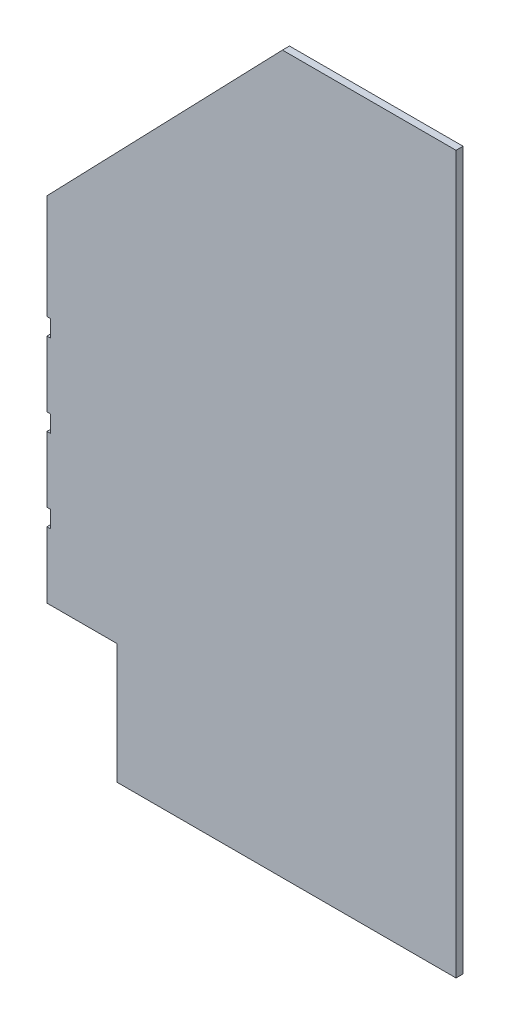
ISO-10303-21;
HEADER;
FILE_DESCRIPTION(('STEP AP214'),'2;1');
FILE_NAME('part.step','',(''),(''),'','','');
FILE_SCHEMA(('AUTOMOTIVE_DESIGN { 1 0 10303 214 1 1 1 1 }'));
ENDSEC;
DATA;
#1=APPLICATION_CONTEXT('core data for automotive mechanical design processes');
#2=APPLICATION_PROTOCOL_DEFINITION('international standard','automotive_design',2000,#1);
#3=PRODUCT_CONTEXT('',#1,'mechanical');
#4=PRODUCT('Part','Part','',(#3));
#5=PRODUCT_RELATED_PRODUCT_CATEGORY('part','',(#4));
#6=PRODUCT_DEFINITION_FORMATION('','',#4);
#7=PRODUCT_DEFINITION_CONTEXT('part definition',#1,'design');
#8=PRODUCT_DEFINITION('design','',#6,#7);
#9=PRODUCT_DEFINITION_SHAPE('','',#8);
#10=(LENGTH_UNIT() NAMED_UNIT(*) SI_UNIT(.MILLI.,.METRE.));
#11=(NAMED_UNIT(*) PLANE_ANGLE_UNIT() SI_UNIT($,.RADIAN.));
#12=(NAMED_UNIT(*) SI_UNIT($,.STERADIAN.) SOLID_ANGLE_UNIT());
#13=UNCERTAINTY_MEASURE_WITH_UNIT(LENGTH_MEASURE(1.E-05),#10,'distance_accuracy_value','');
#14=(GEOMETRIC_REPRESENTATION_CONTEXT(3) GLOBAL_UNCERTAINTY_ASSIGNED_CONTEXT((#13)) GLOBAL_UNIT_ASSIGNED_CONTEXT((#10,
#11,#12)) REPRESENTATION_CONTEXT('',''));
#15=CARTESIAN_POINT('',(0.,0.,0.));
#16=DIRECTION('',(0.,0.,1.));
#17=DIRECTION('',(1.,0.,0.));
#18=AXIS2_PLACEMENT_3D('',#15,#16,#17);
#19=CARTESIAN_POINT('',(-284.234659090909,-116.031818181818,11.90625));
#20=DIRECTION('',(1.,0.,0.));
#21=DIRECTION('',(0.,0.,-1.));
#22=AXIS2_PLACEMENT_3D('',#19,#20,#21);
#23=PLANE('',#22);
#24=DIRECTION('',(0.,-1.,0.));
#25=VECTOR('',#24,1.);
#26=CARTESIAN_POINT('',(-284.234659090909,-116.031818181818,0.));
#27=LINE('',#26,#25);
#28=CARTESIAN_POINT('',(-284.234659090909,-461.281318181818,0.));
#29=VERTEX_POINT('',#28);
#30=CARTESIAN_POINT('',(-284.234659090909,-572.406318181818,0.));
#31=VERTEX_POINT('',#30);
#32=EDGE_CURVE('E186',#29,#31,#27,.T.);
#33=ORIENTED_EDGE('',*,*,#32,.T.);
#34=DIRECTION('',(0.,0.,1.));
#35=VECTOR('',#34,1.);
#36=CARTESIAN_POINT('',(-284.234659090909,-572.406318181818,0.));
#37=LINE('',#36,#35);
#38=CARTESIAN_POINT('',(-284.234659090909,-572.406318181818,11.90625));
#39=VERTEX_POINT('',#38);
#40=EDGE_CURVE('E193',#31,#39,#37,.T.);
#41=ORIENTED_EDGE('',*,*,#40,.T.);
#42=DIRECTION('',(0.,-1.,0.));
#43=VECTOR('',#42,1.);
#44=CARTESIAN_POINT('',(-284.234659090909,-116.031818181818,11.90625));
#45=LINE('',#44,#43);
#46=CARTESIAN_POINT('',(-284.234659090909,-461.281318181818,11.90625));
#47=VERTEX_POINT('',#46);
#48=EDGE_CURVE('E309',#47,#39,#45,.T.);
#49=ORIENTED_EDGE('',*,*,#48,.F.);
#50=DIRECTION('',(0.,0.,1.));
#51=VECTOR('',#50,1.);
#52=CARTESIAN_POINT('',(-284.234659090909,-461.281318181818,0.));
#53=LINE('',#52,#51);
#54=EDGE_CURVE('E218',#29,#47,#53,.T.);
#55=ORIENTED_EDGE('',*,*,#54,.F.);
#56=EDGE_LOOP('',(#33,#41,#49,#55));
#57=FACE_BOUND('',#56,.T.);
#58=ADVANCED_FACE('F32',(#57),#23,.F.);
#59=CARTESIAN_POINT('',(-284.234659090909,-321.581318181818,0.));
#60=VERTEX_POINT('',#59);
#61=CARTESIAN_POINT('',(-284.234659090909,-432.706318181818,0.));
#62=VERTEX_POINT('',#61);
#63=EDGE_CURVE('E191',#60,#62,#27,.T.);
#64=ORIENTED_EDGE('',*,*,#63,.T.);
#65=DIRECTION('',(0.,0.,1.));
#66=VECTOR('',#65,1.);
#67=CARTESIAN_POINT('',(-284.234659090909,-432.706318181818,0.));
#68=LINE('',#67,#66);
#69=CARTESIAN_POINT('',(-284.234659090909,-432.706318181818,11.90625));
#70=VERTEX_POINT('',#69);
#71=EDGE_CURVE('E207',#62,#70,#68,.T.);
#72=ORIENTED_EDGE('',*,*,#71,.T.);
#73=CARTESIAN_POINT('',(-284.234659090909,-321.581318181818,11.90625));
#74=VERTEX_POINT('',#73);
#75=EDGE_CURVE('E268',#74,#70,#45,.T.);
#76=ORIENTED_EDGE('',*,*,#75,.F.);
#77=DIRECTION('',(0.,0.,1.));
#78=VECTOR('',#77,1.);
#79=CARTESIAN_POINT('',(-284.234659090909,-321.581318181818,0.));
#80=LINE('',#79,#78);
#81=EDGE_CURVE('E209',#60,#74,#80,.T.);
#82=ORIENTED_EDGE('',*,*,#81,.F.);
#83=EDGE_LOOP('',(#64,#72,#76,#82));
#84=FACE_BOUND('',#83,.T.);
#85=ADVANCED_FACE('F205',(#84),#23,.F.);
#86=CARTESIAN_POINT('',(-284.234659090909,-116.031818181818,0.));
#87=VERTEX_POINT('',#86);
#88=CARTESIAN_POINT('',(-284.234659090909,-293.006318181818,0.));
#89=VERTEX_POINT('',#88);
#90=EDGE_CURVE('E189',#87,#89,#27,.T.);
#91=ORIENTED_EDGE('',*,*,#90,.T.);
#92=DIRECTION('',(0.,0.,1.));
#93=VECTOR('',#92,1.);
#94=CARTESIAN_POINT('',(-284.234659090909,-293.006318181818,0.));
#95=LINE('',#94,#93);
#96=CARTESIAN_POINT('',(-284.234659090909,-293.006318181818,11.90625));
#97=VERTEX_POINT('',#96);
#98=EDGE_CURVE('E230',#89,#97,#95,.T.);
#99=ORIENTED_EDGE('',*,*,#98,.T.);
#100=CARTESIAN_POINT('',(-284.234659090909,-116.031818181818,11.90625));
#101=VERTEX_POINT('',#100);
#102=EDGE_CURVE('E264',#101,#97,#45,.T.);
#103=ORIENTED_EDGE('',*,*,#102,.F.);
#104=DIRECTION('',(0.,0.,-1.));
#105=VECTOR('',#104,1.);
#106=CARTESIAN_POINT('',(-284.234659090909,-116.031818181818,11.90625));
#107=LINE('',#106,#105);
#108=EDGE_CURVE('E11',#101,#87,#107,.T.);
#109=ORIENTED_EDGE('',*,*,#108,.T.);
#110=EDGE_LOOP('',(#91,#99,#103,#109));
#111=FACE_BOUND('',#110,.T.);
#112=ADVANCED_FACE('F326',(#111),#23,.F.);
#113=CARTESIAN_POINT('',(114.22784090909,296.718181818182,11.90625));
#114=DIRECTION('',(0.719449138392046,-0.694545129755398,0.));
#115=DIRECTION('',(0.694545129755398,0.719449138392046,0.));
#116=AXIS2_PLACEMENT_3D('',#113,#114,#115);
#117=PLANE('',#116);
#118=DIRECTION('',(-0.694545129755398,-0.719449138392046,0.));
#119=VECTOR('',#118,1.);
#120=CARTESIAN_POINT('',(114.22784090909,296.718181818182,0.));
#121=LINE('',#120,#119);
#122=CARTESIAN_POINT('',(114.22784090909,296.718181818182,0.));
#123=VERTEX_POINT('',#122);
#124=EDGE_CURVE('E187',#123,#87,#121,.T.);
#125=ORIENTED_EDGE('',*,*,#124,.T.);
#126=ORIENTED_EDGE('',*,*,#108,.F.);
#127=DIRECTION('',(-0.694545129755398,-0.719449138392046,0.));
#128=VECTOR('',#127,1.);
#129=CARTESIAN_POINT('',(114.22784090909,296.718181818182,11.90625));
#130=LINE('',#129,#128);
#131=CARTESIAN_POINT('',(114.22784090909,296.718181818182,11.90625));
#132=VERTEX_POINT('',#131);
#133=EDGE_CURVE('E260',#132,#101,#130,.T.);
#134=ORIENTED_EDGE('',*,*,#133,.F.);
#135=DIRECTION('',(0.,0.,-1.));
#136=VECTOR('',#135,1.);
#137=CARTESIAN_POINT('',(114.22784090909,296.718181818182,11.90625));
#138=LINE('',#137,#136);
#139=EDGE_CURVE('E277',#132,#123,#138,.T.);
#140=ORIENTED_EDGE('',*,*,#139,.T.);
#141=EDGE_LOOP('',(#125,#126,#134,#140));
#142=FACE_BOUND('',#141,.T.);
#143=ADVANCED_FACE('F34',(#142),#117,.F.);
#144=CARTESIAN_POINT('',(-284.234659090909,-600.981318181818,11.90625));
#145=VERTEX_POINT('',#144);
#146=CARTESIAN_POINT('',(-284.234659090909,-712.931818181818,11.90625));
#147=VERTEX_POINT('',#146);
#148=EDGE_CURVE('E179',#145,#147,#45,.T.);
#149=ORIENTED_EDGE('',*,*,#148,.F.);
#150=DIRECTION('',(0.,0.,1.));
#151=VECTOR('',#150,1.);
#152=CARTESIAN_POINT('',(-284.234659090909,-600.981318181818,0.));
#153=LINE('',#152,#151);
#154=CARTESIAN_POINT('',(-284.234659090909,-600.981318181818,0.));
#155=VERTEX_POINT('',#154);
#156=EDGE_CURVE('E166',#155,#145,#153,.T.);
#157=ORIENTED_EDGE('',*,*,#156,.F.);
#158=CARTESIAN_POINT('',(-284.234659090909,-712.931818181818,0.));
#159=VERTEX_POINT('',#158);
#160=EDGE_CURVE('E177',#155,#159,#27,.T.);
#161=ORIENTED_EDGE('',*,*,#160,.T.);
#162=DIRECTION('',(0.,0.,-1.));
#163=VECTOR('',#162,1.);
#164=CARTESIAN_POINT('',(-284.234659090909,-712.931818181818,11.90625));
#165=LINE('',#164,#163);
#166=EDGE_CURVE('E40',#147,#159,#165,.T.);
#167=ORIENTED_EDGE('',*,*,#166,.F.);
#168=EDGE_LOOP('',(#149,#157,#161,#167));
#169=FACE_BOUND('',#168,.T.);
#170=ADVANCED_FACE('F175',(#169),#23,.F.);
#171=CARTESIAN_POINT('',(-284.234659090909,-712.931818181818,11.90625));
#172=DIRECTION('',(0.,1.,0.));
#173=DIRECTION('',(0.,0.,1.));
#174=AXIS2_PLACEMENT_3D('',#171,#172,#173);
#175=PLANE('',#174);
#176=DIRECTION('',(1.,0.,0.));
#177=VECTOR('',#176,1.);
#178=CARTESIAN_POINT('',(-284.234659090909,-712.931818181818,0.));
#179=LINE('',#178,#177);
#180=CARTESIAN_POINT('',(-165.965909090909,-712.931818181818,0.));
#181=VERTEX_POINT('',#180);
#182=EDGE_CURVE('E185',#159,#181,#179,.T.);
#183=ORIENTED_EDGE('',*,*,#182,.T.);
#184=DIRECTION('',(0.,0.,-1.));
#185=VECTOR('',#184,1.);
#186=CARTESIAN_POINT('',(-165.965909090909,-712.931818181818,11.90625));
#187=LINE('',#186,#185);
#188=CARTESIAN_POINT('',(-165.965909090909,-712.931818181818,11.90625));
#189=VERTEX_POINT('',#188);
#190=EDGE_CURVE('E298',#189,#181,#187,.T.);
#191=ORIENTED_EDGE('',*,*,#190,.F.);
#192=DIRECTION('',(1.,0.,0.));
#193=VECTOR('',#192,1.);
#194=CARTESIAN_POINT('',(-284.234659090909,-712.931818181818,11.90625));
#195=LINE('',#194,#193);
#196=EDGE_CURVE('E267',#147,#189,#195,.T.);
#197=ORIENTED_EDGE('',*,*,#196,.F.);
#198=ORIENTED_EDGE('',*,*,#166,.T.);
#199=EDGE_LOOP('',(#183,#191,#197,#198));
#200=FACE_BOUND('',#199,.T.);
#201=ADVANCED_FACE('F302',(#200),#175,.F.);
#202=CARTESIAN_POINT('',(-165.965909090909,-916.131818181818,11.90625));
#203=DIRECTION('',(1.,0.,0.));
#204=DIRECTION('',(0.,0.,-1.));
#205=AXIS2_PLACEMENT_3D('',#202,#203,#204);
#206=PLANE('',#205);
#207=DIRECTION('',(0.,-1.,0.));
#208=VECTOR('',#207,1.);
#209=CARTESIAN_POINT('',(-165.965909090909,-916.131818181818,0.));
#210=LINE('',#209,#208);
#211=CARTESIAN_POINT('',(-165.965909090909,-916.131818181818,0.));
#212=VERTEX_POINT('',#211);
#213=EDGE_CURVE('E199',#181,#212,#210,.T.);
#214=ORIENTED_EDGE('',*,*,#213,.T.);
#215=DIRECTION('',(0.,0.,-1.));
#216=VECTOR('',#215,1.);
#217=CARTESIAN_POINT('',(-165.965909090909,-916.131818181818,11.90625));
#218=LINE('',#217,#216);
#219=CARTESIAN_POINT('',(-165.965909090909,-916.131818181818,11.90625));
#220=VERTEX_POINT('',#219);
#221=EDGE_CURVE('E295',#220,#212,#218,.T.);
#222=ORIENTED_EDGE('',*,*,#221,.F.);
#223=DIRECTION('',(0.,-1.,0.));
#224=VECTOR('',#223,1.);
#225=CARTESIAN_POINT('',(-165.965909090909,-916.131818181818,11.90625));
#226=LINE('',#225,#224);
#227=EDGE_CURVE('E270',#189,#220,#226,.T.);
#228=ORIENTED_EDGE('',*,*,#227,.F.);
#229=ORIENTED_EDGE('',*,*,#190,.T.);
#230=EDGE_LOOP('',(#214,#222,#228,#229));
#231=FACE_BOUND('',#230,.T.);
#232=ADVANCED_FACE('F339',(#231),#206,.F.);
#233=CARTESIAN_POINT('',(-165.965909090909,-916.131818181818,11.90625));
#234=DIRECTION('',(0.,1.,0.));
#235=DIRECTION('',(0.,0.,1.));
#236=AXIS2_PLACEMENT_3D('',#233,#234,#235);
#237=PLANE('',#236);
#238=DIRECTION('',(1.,0.,0.));
#239=VECTOR('',#238,1.);
#240=CARTESIAN_POINT('',(-165.965909090909,-916.131818181818,0.));
#241=LINE('',#240,#239);
#242=CARTESIAN_POINT('',(407.91534090909,-916.131818181818,0.));
#243=VERTEX_POINT('',#242);
#244=EDGE_CURVE('E333',#212,#243,#241,.T.);
#245=ORIENTED_EDGE('',*,*,#244,.T.);
#246=DIRECTION('',(0.,0.,-1.));
#247=VECTOR('',#246,1.);
#248=CARTESIAN_POINT('',(407.91534090909,-916.131818181818,11.90625));
#249=LINE('',#248,#247);
#250=CARTESIAN_POINT('',(407.91534090909,-916.131818181818,11.90625));
#251=VERTEX_POINT('',#250);
#252=EDGE_CURVE('E288',#251,#243,#249,.T.);
#253=ORIENTED_EDGE('',*,*,#252,.F.);
#254=DIRECTION('',(1.,0.,0.));
#255=VECTOR('',#254,1.);
#256=CARTESIAN_POINT('',(-165.965909090909,-916.131818181818,11.90625));
#257=LINE('',#256,#255);
#258=EDGE_CURVE('E272',#220,#251,#257,.T.);
#259=ORIENTED_EDGE('',*,*,#258,.F.);
#260=ORIENTED_EDGE('',*,*,#221,.T.);
#261=EDGE_LOOP('',(#245,#253,#259,#260));
#262=FACE_BOUND('',#261,.T.);
#263=ADVANCED_FACE('F342',(#262),#237,.F.);
#264=CARTESIAN_POINT('',(407.91534090909,296.718181818182,11.90625));
#265=DIRECTION('',(-1.,0.,0.));
#266=DIRECTION('',(0.,-1.,0.));
#267=AXIS2_PLACEMENT_3D('',#264,#265,#266);
#268=PLANE('',#267);
#269=DIRECTION('',(0.,1.,0.));
#270=VECTOR('',#269,1.);
#271=CARTESIAN_POINT('',(407.91534090909,296.718181818182,0.));
#272=LINE('',#271,#270);
#273=CARTESIAN_POINT('',(407.91534090909,296.718181818182,0.));
#274=VERTEX_POINT('',#273);
#275=EDGE_CURVE('E331',#243,#274,#272,.T.);
#276=ORIENTED_EDGE('',*,*,#275,.T.);
#277=DIRECTION('',(0.,0.,-1.));
#278=VECTOR('',#277,1.);
#279=CARTESIAN_POINT('',(407.91534090909,296.718181818182,11.90625));
#280=LINE('',#279,#278);
#281=CARTESIAN_POINT('',(407.91534090909,296.718181818182,11.90625));
#282=VERTEX_POINT('',#281);
#283=EDGE_CURVE('E282',#282,#274,#280,.T.);
#284=ORIENTED_EDGE('',*,*,#283,.F.);
#285=DIRECTION('',(0.,1.,0.));
#286=VECTOR('',#285,1.);
#287=CARTESIAN_POINT('',(407.91534090909,296.718181818182,11.90625));
#288=LINE('',#287,#286);
#289=EDGE_CURVE('E274',#251,#282,#288,.T.);
#290=ORIENTED_EDGE('',*,*,#289,.F.);
#291=ORIENTED_EDGE('',*,*,#252,.T.);
#292=EDGE_LOOP('',(#276,#284,#290,#291));
#293=FACE_BOUND('',#292,.T.);
#294=ADVANCED_FACE('F345',(#293),#268,.F.);
#295=CARTESIAN_POINT('',(407.91534090909,296.718181818182,11.90625));
#296=DIRECTION('',(0.,-1.,0.));
#297=DIRECTION('',(0.,0.,-1.));
#298=AXIS2_PLACEMENT_3D('',#295,#296,#297);
#299=PLANE('',#298);
#300=DIRECTION('',(-1.,0.,0.));
#301=VECTOR('',#300,1.);
#302=CARTESIAN_POINT('',(407.91534090909,296.718181818182,0.));
#303=LINE('',#302,#301);
#304=EDGE_CURVE('E263',#274,#123,#303,.T.);
#305=ORIENTED_EDGE('',*,*,#304,.T.);
#306=ORIENTED_EDGE('',*,*,#139,.F.);
#307=DIRECTION('',(-1.,0.,0.));
#308=VECTOR('',#307,1.);
#309=CARTESIAN_POINT('',(407.91534090909,296.718181818182,11.90625));
#310=LINE('',#309,#308);
#311=EDGE_CURVE('E276',#282,#132,#310,.T.);
#312=ORIENTED_EDGE('',*,*,#311,.F.);
#313=ORIENTED_EDGE('',*,*,#283,.T.);
#314=EDGE_LOOP('',(#305,#306,#312,#313));
#315=FACE_BOUND('',#314,.T.);
#316=ADVANCED_FACE('F346',(#315),#299,.F.);
#317=CARTESIAN_POINT('',(0.,0.,11.90625));
#318=DIRECTION('',(0.,0.,1.));
#319=DIRECTION('',(1.,0.,0.));
#320=AXIS2_PLACEMENT_3D('',#317,#318,#319);
#321=PLANE('',#320);
#322=DIRECTION('',(-1.,0.,0.));
#323=VECTOR('',#322,1.);
#324=CARTESIAN_POINT('',(-284.234659090909,-572.406318181818,11.90625));
#325=LINE('',#324,#323);
#326=CARTESIAN_POINT('',(-277.884659090909,-572.406318181818,11.90625));
#327=VERTEX_POINT('',#326);
#328=EDGE_CURVE('E171',#327,#39,#325,.T.);
#329=ORIENTED_EDGE('',*,*,#328,.F.);
#330=DIRECTION('',(0.,1.,0.));
#331=VECTOR('',#330,1.);
#332=CARTESIAN_POINT('',(-277.884659090909,-600.981318181818,11.90625));
#333=LINE('',#332,#331);
#334=CARTESIAN_POINT('',(-277.884659090909,-600.981318181818,11.90625));
#335=VERTEX_POINT('',#334);
#336=EDGE_CURVE('E519',#335,#327,#333,.T.);
#337=ORIENTED_EDGE('',*,*,#336,.F.);
#338=DIRECTION('',(1.,0.,0.));
#339=VECTOR('',#338,1.);
#340=CARTESIAN_POINT('',(-284.234659090909,-600.981318181818,11.90625));
#341=LINE('',#340,#339);
#342=EDGE_CURVE('E236',#145,#335,#341,.T.);
#343=ORIENTED_EDGE('',*,*,#342,.F.);
#344=ORIENTED_EDGE('',*,*,#148,.T.);
#345=ORIENTED_EDGE('',*,*,#196,.T.);
#346=ORIENTED_EDGE('',*,*,#227,.T.);
#347=ORIENTED_EDGE('',*,*,#258,.T.);
#348=ORIENTED_EDGE('',*,*,#289,.T.);
#349=ORIENTED_EDGE('',*,*,#311,.T.);
#350=ORIENTED_EDGE('',*,*,#133,.T.);
#351=ORIENTED_EDGE('',*,*,#102,.T.);
#352=DIRECTION('',(-1.,0.,0.));
#353=VECTOR('',#352,1.);
#354=CARTESIAN_POINT('',(-284.234659090909,-293.006318181818,11.90625));
#355=LINE('',#354,#353);
#356=CARTESIAN_POINT('',(-277.884659090909,-293.006318181818,11.90625));
#357=VERTEX_POINT('',#356);
#358=EDGE_CURVE('E242',#357,#97,#355,.T.);
#359=ORIENTED_EDGE('',*,*,#358,.F.);
#360=DIRECTION('',(0.,1.,0.));
#361=VECTOR('',#360,1.);
#362=CARTESIAN_POINT('',(-277.884659090909,-321.581318181818,11.90625));
#363=LINE('',#362,#361);
#364=CARTESIAN_POINT('',(-277.884659090909,-321.581318181818,11.90625));
#365=VERTEX_POINT('',#364);
#366=EDGE_CURVE('E250',#365,#357,#363,.T.);
#367=ORIENTED_EDGE('',*,*,#366,.F.);
#368=DIRECTION('',(1.,0.,0.));
#369=VECTOR('',#368,1.);
#370=CARTESIAN_POINT('',(-284.234659090909,-321.581318181818,11.90625));
#371=LINE('',#370,#369);
#372=EDGE_CURVE('E247',#74,#365,#371,.T.);
#373=ORIENTED_EDGE('',*,*,#372,.F.);
#374=ORIENTED_EDGE('',*,*,#75,.T.);
#375=DIRECTION('',(-1.,0.,0.));
#376=VECTOR('',#375,1.);
#377=CARTESIAN_POINT('',(-284.234659090909,-432.706318181818,11.90625));
#378=LINE('',#377,#376);
#379=CARTESIAN_POINT('',(-277.884659090909,-432.706318181818,11.90625));
#380=VERTEX_POINT('',#379);
#381=EDGE_CURVE('E233',#380,#70,#378,.T.);
#382=ORIENTED_EDGE('',*,*,#381,.F.);
#383=DIRECTION('',(0.,1.,0.));
#384=VECTOR('',#383,1.);
#385=CARTESIAN_POINT('',(-277.884659090909,-461.281318181818,11.90625));
#386=LINE('',#385,#384);
#387=CARTESIAN_POINT('',(-277.884659090909,-461.281318181818,11.90625));
#388=VERTEX_POINT('',#387);
#389=EDGE_CURVE('E229',#388,#380,#386,.T.);
#390=ORIENTED_EDGE('',*,*,#389,.F.);
#391=DIRECTION('',(1.,0.,0.));
#392=VECTOR('',#391,1.);
#393=CARTESIAN_POINT('',(-284.234659090909,-461.281318181818,11.90625));
#394=LINE('',#393,#392);
#395=EDGE_CURVE('E226',#47,#388,#394,.T.);
#396=ORIENTED_EDGE('',*,*,#395,.F.);
#397=ORIENTED_EDGE('',*,*,#48,.T.);
#398=EDGE_LOOP('',(#329,#337,#343,#344,#345,#346,#347,#348,#349,#350,#351,#359,#367,#373,#374,
#382,#390,#396,#397));
#399=FACE_BOUND('',#398,.T.);
#400=ADVANCED_FACE('F306',(#399),#321,.T.);
#401=CARTESIAN_POINT('',(0.,0.,0.));
#402=DIRECTION('',(0.,0.,1.));
#403=DIRECTION('',(1.,0.,0.));
#404=AXIS2_PLACEMENT_3D('',#401,#402,#403);
#405=PLANE('',#404);
#406=DIRECTION('',(0.,1.,0.));
#407=VECTOR('',#406,1.);
#408=CARTESIAN_POINT('',(-277.884659090909,-600.981318181818,0.));
#409=LINE('',#408,#407);
#410=CARTESIAN_POINT('',(-277.884659090909,-600.981318181818,0.));
#411=VERTEX_POINT('',#410);
#412=CARTESIAN_POINT('',(-277.884659090909,-572.406318181818,0.));
#413=VERTEX_POINT('',#412);
#414=EDGE_CURVE('E47',#411,#413,#409,.T.);
#415=ORIENTED_EDGE('',*,*,#414,.T.);
#416=DIRECTION('',(-1.,0.,0.));
#417=VECTOR('',#416,1.);
#418=CARTESIAN_POINT('',(-284.234659090909,-572.406318181818,0.));
#419=LINE('',#418,#417);
#420=EDGE_CURVE('E180',#413,#31,#419,.T.);
#421=ORIENTED_EDGE('',*,*,#420,.T.);
#422=ORIENTED_EDGE('',*,*,#32,.F.);
#423=DIRECTION('',(1.,0.,0.));
#424=VECTOR('',#423,1.);
#425=CARTESIAN_POINT('',(-284.234659090909,-461.281318181818,0.));
#426=LINE('',#425,#424);
#427=CARTESIAN_POINT('',(-277.884659090909,-461.281318181818,0.));
#428=VERTEX_POINT('',#427);
#429=EDGE_CURVE('E222',#29,#428,#426,.T.);
#430=ORIENTED_EDGE('',*,*,#429,.T.);
#431=DIRECTION('',(0.,1.,0.));
#432=VECTOR('',#431,1.);
#433=CARTESIAN_POINT('',(-277.884659090909,-461.281318181818,0.));
#434=LINE('',#433,#432);
#435=CARTESIAN_POINT('',(-277.884659090909,-432.706318181818,0.));
#436=VERTEX_POINT('',#435);
#437=EDGE_CURVE('E55',#428,#436,#434,.T.);
#438=ORIENTED_EDGE('',*,*,#437,.T.);
#439=DIRECTION('',(-1.,0.,0.));
#440=VECTOR('',#439,1.);
#441=CARTESIAN_POINT('',(-284.234659090909,-432.706318181818,0.));
#442=LINE('',#441,#440);
#443=EDGE_CURVE('E215',#436,#62,#442,.T.);
#444=ORIENTED_EDGE('',*,*,#443,.T.);
#445=ORIENTED_EDGE('',*,*,#63,.F.);
#446=DIRECTION('',(1.,0.,0.));
#447=VECTOR('',#446,1.);
#448=CARTESIAN_POINT('',(-284.234659090909,-321.581318181818,0.));
#449=LINE('',#448,#447);
#450=CARTESIAN_POINT('',(-277.884659090909,-321.581318181818,0.));
#451=VERTEX_POINT('',#450);
#452=EDGE_CURVE('E213',#60,#451,#449,.T.);
#453=ORIENTED_EDGE('',*,*,#452,.T.);
#454=DIRECTION('',(0.,1.,0.));
#455=VECTOR('',#454,1.);
#456=CARTESIAN_POINT('',(-277.884659090909,-321.581318181818,0.));
#457=LINE('',#456,#455);
#458=CARTESIAN_POINT('',(-277.884659090909,-293.006318181818,0.));
#459=VERTEX_POINT('',#458);
#460=EDGE_CURVE('E241',#451,#459,#457,.T.);
#461=ORIENTED_EDGE('',*,*,#460,.T.);
#462=DIRECTION('',(-1.,0.,0.));
#463=VECTOR('',#462,1.);
#464=CARTESIAN_POINT('',(-284.234659090909,-293.006318181818,0.));
#465=LINE('',#464,#463);
#466=EDGE_CURVE('E244',#459,#89,#465,.T.);
#467=ORIENTED_EDGE('',*,*,#466,.T.);
#468=ORIENTED_EDGE('',*,*,#90,.F.);
#469=ORIENTED_EDGE('',*,*,#124,.F.);
#470=ORIENTED_EDGE('',*,*,#304,.F.);
#471=ORIENTED_EDGE('',*,*,#275,.F.);
#472=ORIENTED_EDGE('',*,*,#244,.F.);
#473=ORIENTED_EDGE('',*,*,#213,.F.);
#474=ORIENTED_EDGE('',*,*,#182,.F.);
#475=ORIENTED_EDGE('',*,*,#160,.F.);
#476=DIRECTION('',(1.,0.,0.));
#477=VECTOR('',#476,1.);
#478=CARTESIAN_POINT('',(-284.234659090909,-600.981318181818,0.));
#479=LINE('',#478,#477);
#480=EDGE_CURVE('E162',#155,#411,#479,.T.);
#481=ORIENTED_EDGE('',*,*,#480,.T.);
#482=EDGE_LOOP('',(#415,#421,#422,#430,#438,#444,#445,#453,#461,#467,#468,#469,#470,#471,#472,
#473,#474,#475,#481));
#483=FACE_BOUND('',#482,.T.);
#484=ADVANCED_FACE('F183',(#483),#405,.F.);
#485=CARTESIAN_POINT('',(-284.234659090909,-293.006318181818,0.));
#486=DIRECTION('',(0.,1.,0.));
#487=DIRECTION('',(0.,0.,1.));
#488=AXIS2_PLACEMENT_3D('',#485,#486,#487);
#489=PLANE('',#488);
#490=ORIENTED_EDGE('',*,*,#358,.T.);
#491=ORIENTED_EDGE('',*,*,#98,.F.);
#492=ORIENTED_EDGE('',*,*,#466,.F.);
#493=DIRECTION('',(0.,0.,1.));
#494=VECTOR('',#493,1.);
#495=CARTESIAN_POINT('',(-277.884659090909,-293.006318181818,0.));
#496=LINE('',#495,#494);
#497=EDGE_CURVE('E255',#459,#357,#496,.T.);
#498=ORIENTED_EDGE('',*,*,#497,.T.);
#499=EDGE_LOOP('',(#490,#491,#492,#498));
#500=FACE_BOUND('',#499,.T.);
#501=ADVANCED_FACE('F325',(#500),#489,.F.);
#502=CARTESIAN_POINT('',(-277.884659090909,-321.581318181818,0.));
#503=DIRECTION('',(1.,0.,0.));
#504=DIRECTION('',(0.,0.,-1.));
#505=AXIS2_PLACEMENT_3D('',#502,#503,#504);
#506=PLANE('',#505);
#507=ORIENTED_EDGE('',*,*,#366,.T.);
#508=ORIENTED_EDGE('',*,*,#497,.F.);
#509=ORIENTED_EDGE('',*,*,#460,.F.);
#510=DIRECTION('',(0.,0.,1.));
#511=VECTOR('',#510,1.);
#512=CARTESIAN_POINT('',(-277.884659090909,-321.581318181818,0.));
#513=LINE('',#512,#511);
#514=EDGE_CURVE('E257',#451,#365,#513,.T.);
#515=ORIENTED_EDGE('',*,*,#514,.T.);
#516=EDGE_LOOP('',(#507,#508,#509,#515));
#517=FACE_BOUND('',#516,.T.);
#518=ADVANCED_FACE('F322',(#517),#506,.F.);
#519=CARTESIAN_POINT('',(-284.234659090909,-321.581318181818,0.));
#520=DIRECTION('',(0.,-1.,0.));
#521=DIRECTION('',(0.,0.,-1.));
#522=AXIS2_PLACEMENT_3D('',#519,#520,#521);
#523=PLANE('',#522);
#524=ORIENTED_EDGE('',*,*,#372,.T.);
#525=ORIENTED_EDGE('',*,*,#514,.F.);
#526=ORIENTED_EDGE('',*,*,#452,.F.);
#527=ORIENTED_EDGE('',*,*,#81,.T.);
#528=EDGE_LOOP('',(#524,#525,#526,#527));
#529=FACE_BOUND('',#528,.T.);
#530=ADVANCED_FACE('F320',(#529),#523,.F.);
#531=CARTESIAN_POINT('',(-284.234659090909,-432.706318181818,0.));
#532=DIRECTION('',(0.,1.,0.));
#533=DIRECTION('',(0.,0.,1.));
#534=AXIS2_PLACEMENT_3D('',#531,#532,#533);
#535=PLANE('',#534);
#536=ORIENTED_EDGE('',*,*,#381,.T.);
#537=ORIENTED_EDGE('',*,*,#71,.F.);
#538=ORIENTED_EDGE('',*,*,#443,.F.);
#539=DIRECTION('',(0.,0.,1.));
#540=VECTOR('',#539,1.);
#541=CARTESIAN_POINT('',(-277.884659090909,-432.706318181818,0.));
#542=LINE('',#541,#540);
#543=EDGE_CURVE('E237',#436,#380,#542,.T.);
#544=ORIENTED_EDGE('',*,*,#543,.T.);
#545=EDGE_LOOP('',(#536,#537,#538,#544));
#546=FACE_BOUND('',#545,.T.);
#547=ADVANCED_FACE('F455',(#546),#535,.F.);
#548=CARTESIAN_POINT('',(-277.884659090909,-461.281318181818,0.));
#549=DIRECTION('',(1.,0.,0.));
#550=DIRECTION('',(0.,0.,-1.));
#551=AXIS2_PLACEMENT_3D('',#548,#549,#550);
#552=PLANE('',#551);
#553=ORIENTED_EDGE('',*,*,#389,.T.);
#554=ORIENTED_EDGE('',*,*,#543,.F.);
#555=ORIENTED_EDGE('',*,*,#437,.F.);
#556=DIRECTION('',(0.,0.,1.));
#557=VECTOR('',#556,1.);
#558=CARTESIAN_POINT('',(-277.884659090909,-461.281318181818,0.));
#559=LINE('',#558,#557);
#560=EDGE_CURVE('E220',#428,#388,#559,.T.);
#561=ORIENTED_EDGE('',*,*,#560,.T.);
#562=EDGE_LOOP('',(#553,#554,#555,#561));
#563=FACE_BOUND('',#562,.T.);
#564=ADVANCED_FACE('F462',(#563),#552,.F.);
#565=CARTESIAN_POINT('',(-284.234659090909,-461.281318181818,0.));
#566=DIRECTION('',(0.,-1.,0.));
#567=DIRECTION('',(0.,0.,-1.));
#568=AXIS2_PLACEMENT_3D('',#565,#566,#567);
#569=PLANE('',#568);
#570=ORIENTED_EDGE('',*,*,#395,.T.);
#571=ORIENTED_EDGE('',*,*,#560,.F.);
#572=ORIENTED_EDGE('',*,*,#429,.F.);
#573=ORIENTED_EDGE('',*,*,#54,.T.);
#574=EDGE_LOOP('',(#570,#571,#572,#573));
#575=FACE_BOUND('',#574,.T.);
#576=ADVANCED_FACE('F469',(#575),#569,.F.);
#577=CARTESIAN_POINT('',(-284.234659090909,-572.406318181818,0.));
#578=DIRECTION('',(0.,1.,0.));
#579=DIRECTION('',(0.,0.,1.));
#580=AXIS2_PLACEMENT_3D('',#577,#578,#579);
#581=PLANE('',#580);
#582=ORIENTED_EDGE('',*,*,#328,.T.);
#583=ORIENTED_EDGE('',*,*,#40,.F.);
#584=ORIENTED_EDGE('',*,*,#420,.F.);
#585=DIRECTION('',(0.,0.,1.));
#586=VECTOR('',#585,1.);
#587=CARTESIAN_POINT('',(-277.884659090909,-572.406318181818,0.));
#588=LINE('',#587,#586);
#589=EDGE_CURVE('E520',#413,#327,#588,.T.);
#590=ORIENTED_EDGE('',*,*,#589,.T.);
#591=EDGE_LOOP('',(#582,#583,#584,#590));
#592=FACE_BOUND('',#591,.T.);
#593=ADVANCED_FACE('F476',(#592),#581,.F.);
#594=CARTESIAN_POINT('',(-277.884659090909,-600.981318181818,0.));
#595=DIRECTION('',(1.,0.,0.));
#596=DIRECTION('',(0.,0.,-1.));
#597=AXIS2_PLACEMENT_3D('',#594,#595,#596);
#598=PLANE('',#597);
#599=ORIENTED_EDGE('',*,*,#336,.T.);
#600=ORIENTED_EDGE('',*,*,#589,.F.);
#601=ORIENTED_EDGE('',*,*,#414,.F.);
#602=DIRECTION('',(0.,0.,1.));
#603=VECTOR('',#602,1.);
#604=CARTESIAN_POINT('',(-277.884659090909,-600.981318181818,0.));
#605=LINE('',#604,#603);
#606=EDGE_CURVE('E168',#411,#335,#605,.T.);
#607=ORIENTED_EDGE('',*,*,#606,.T.);
#608=EDGE_LOOP('',(#599,#600,#601,#607));
#609=FACE_BOUND('',#608,.T.);
#610=ADVANCED_FACE('F484',(#609),#598,.F.);
#611=CARTESIAN_POINT('',(-284.234659090909,-600.981318181818,0.));
#612=DIRECTION('',(0.,-1.,0.));
#613=DIRECTION('',(0.,0.,-1.));
#614=AXIS2_PLACEMENT_3D('',#611,#612,#613);
#615=PLANE('',#614);
#616=ORIENTED_EDGE('',*,*,#342,.T.);
#617=ORIENTED_EDGE('',*,*,#606,.F.);
#618=ORIENTED_EDGE('',*,*,#480,.F.);
#619=ORIENTED_EDGE('',*,*,#156,.T.);
#620=EDGE_LOOP('',(#616,#617,#618,#619));
#621=FACE_BOUND('',#620,.T.);
#622=ADVANCED_FACE('F165',(#621),#615,.F.);
#623=CLOSED_SHELL('',(#58,#85,#112,#143,#170,#201,#232,#263,#294,#316,#400,#484,#501,#518,#530,
#547,#564,#576,#593,#610,#622));
#624=MANIFOLD_SOLID_BREP('B2',#623);
#625=ADVANCED_BREP_SHAPE_REPRESENTATION('',(#18,#624),#14);
#626=SHAPE_DEFINITION_REPRESENTATION(#9,#625);
ENDSEC;
END-ISO-10303-21;
